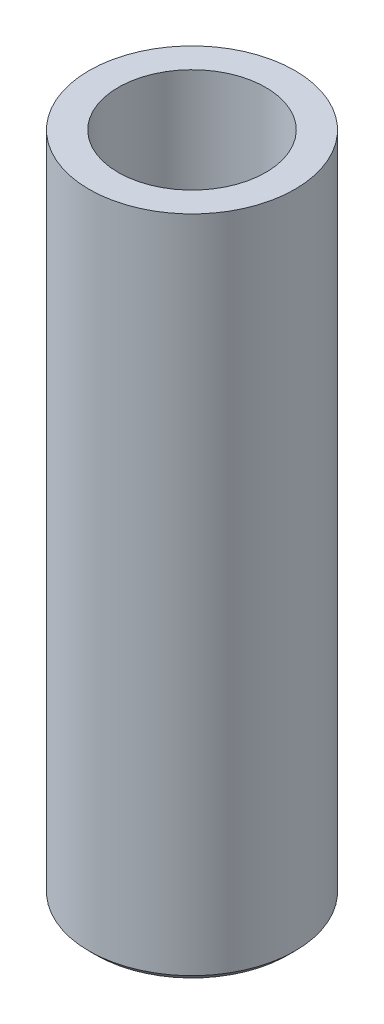
ISO-10303-21;
HEADER;
FILE_DESCRIPTION(('STEP AP214'),'2;1');
FILE_NAME('part.step','',(''),(''),'','','');
FILE_SCHEMA(('AUTOMOTIVE_DESIGN { 1 0 10303 214 1 1 1 1 }'));
ENDSEC;
DATA;
#1=APPLICATION_CONTEXT('core data for automotive mechanical design processes');
#2=APPLICATION_PROTOCOL_DEFINITION('international standard','automotive_design',2000,#1);
#3=PRODUCT_CONTEXT('',#1,'mechanical');
#4=PRODUCT('Part','Part','',(#3));
#5=PRODUCT_RELATED_PRODUCT_CATEGORY('part','',(#4));
#6=PRODUCT_DEFINITION_FORMATION('','',#4);
#7=PRODUCT_DEFINITION_CONTEXT('part definition',#1,'design');
#8=PRODUCT_DEFINITION('design','',#6,#7);
#9=PRODUCT_DEFINITION_SHAPE('','',#8);
#10=(LENGTH_UNIT() NAMED_UNIT(*) SI_UNIT(.MILLI.,.METRE.));
#11=(NAMED_UNIT(*) PLANE_ANGLE_UNIT() SI_UNIT($,.RADIAN.));
#12=(NAMED_UNIT(*) SI_UNIT($,.STERADIAN.) SOLID_ANGLE_UNIT());
#13=UNCERTAINTY_MEASURE_WITH_UNIT(LENGTH_MEASURE(1.E-05),#10,'distance_accuracy_value','');
#14=(GEOMETRIC_REPRESENTATION_CONTEXT(3) GLOBAL_UNCERTAINTY_ASSIGNED_CONTEXT((#13)) GLOBAL_UNIT_ASSIGNED_CONTEXT((#10,
#11,#12)) REPRESENTATION_CONTEXT('',''));
#15=CARTESIAN_POINT('',(0.,0.,0.));
#16=DIRECTION('',(0.,0.,1.));
#17=DIRECTION('',(1.,0.,0.));
#18=AXIS2_PLACEMENT_3D('',#15,#16,#17);
#19=CARTESIAN_POINT('',(0.,1.,0.));
#20=DIRECTION('',(0.,-1.,0.));
#21=DIRECTION('',(0.,0.,-1.));
#22=AXIS2_PLACEMENT_3D('',#19,#20,#21);
#23=CYLINDRICAL_SURFACE('',#22,6.);
#24=CARTESIAN_POINT('',(0.,0.399999999999996,0.));
#25=DIRECTION('',(0.,1.,0.));
#26=DIRECTION('',(0.,0.,1.));
#27=AXIS2_PLACEMENT_3D('',#24,#25,#26);
#28=CIRCLE('',#27,6.);
#29=CARTESIAN_POINT('',(0.,0.399999999999996,6.));
#30=VERTEX_POINT('',#29);
#31=EDGE_CURVE('E49',#30,#30,#28,.T.);
#32=ORIENTED_EDGE('',*,*,#31,.T.);
#33=EDGE_LOOP('',(#32));
#34=FACE_BOUND('',#33,.T.);
#35=CARTESIAN_POINT('',(0.,38.86,0.));
#36=DIRECTION('',(0.,1.,0.));
#37=DIRECTION('',(0.,0.,1.));
#38=AXIS2_PLACEMENT_3D('',#35,#36,#37);
#39=CIRCLE('',#38,6.);
#40=CARTESIAN_POINT('',(0.,38.86,6.));
#41=VERTEX_POINT('',#40);
#42=EDGE_CURVE('E57',#41,#41,#39,.T.);
#43=ORIENTED_EDGE('',*,*,#42,.F.);
#44=EDGE_LOOP('',(#43));
#45=FACE_BOUND('',#44,.T.);
#46=ADVANCED_FACE('F42',(#34,#45),#23,.T.);
#47=CARTESIAN_POINT('',(0.,0.,0.));
#48=DIRECTION('',(0.,1.,0.));
#49=DIRECTION('',(0.,0.,1.));
#50=AXIS2_PLACEMENT_3D('',#47,#48,#49);
#51=PLANE('',#50);
#52=CARTESIAN_POINT('',(0.,0.,0.));
#53=DIRECTION('',(0.,1.,0.));
#54=DIRECTION('',(0.,0.,1.));
#55=AXIS2_PLACEMENT_3D('',#52,#53,#54);
#56=CIRCLE('',#55,5.6);
#57=CARTESIAN_POINT('',(0.,0.,5.6));
#58=VERTEX_POINT('',#57);
#59=EDGE_CURVE('E12',#58,#58,#56,.F.);
#60=ORIENTED_EDGE('',*,*,#59,.T.);
#61=EDGE_LOOP('',(#60));
#62=FACE_BOUND('',#61,.T.);
#63=ADVANCED_FACE('F71',(#62),#51,.F.);
#64=CARTESIAN_POINT('',(0.,38.86,0.));
#65=DIRECTION('',(0.,1.,0.));
#66=DIRECTION('',(0.,0.,1.));
#67=AXIS2_PLACEMENT_3D('',#64,#65,#66);
#68=PLANE('',#67);
#69=ORIENTED_EDGE('',*,*,#42,.T.);
#70=EDGE_LOOP('',(#69));
#71=FACE_BOUND('',#70,.T.);
#72=CARTESIAN_POINT('',(0.,38.86,0.));
#73=DIRECTION('',(0.,1.,0.));
#74=DIRECTION('',(0.,0.,1.));
#75=AXIS2_PLACEMENT_3D('',#72,#73,#74);
#76=CIRCLE('',#75,4.3);
#77=CARTESIAN_POINT('',(0.,38.86,4.3));
#78=VERTEX_POINT('',#77);
#79=EDGE_CURVE('E62',#78,#78,#76,.T.);
#80=ORIENTED_EDGE('',*,*,#79,.F.);
#81=EDGE_LOOP('',(#80));
#82=FACE_BOUND('',#81,.T.);
#83=ADVANCED_FACE('F69',(#71,#82),#68,.T.);
#84=CARTESIAN_POINT('',(0.,38.86,0.));
#85=DIRECTION('',(0.,-1.,0.));
#86=DIRECTION('',(0.,0.,-1.));
#87=AXIS2_PLACEMENT_3D('',#84,#85,#86);
#88=CYLINDRICAL_SURFACE('',#87,4.3);
#89=ORIENTED_EDGE('',*,*,#79,.T.);
#90=EDGE_LOOP('',(#89));
#91=FACE_BOUND('',#90,.T.);
#92=CARTESIAN_POINT('',(0.,1.,0.));
#93=DIRECTION('',(0.,1.,0.));
#94=DIRECTION('',(0.,0.,1.));
#95=AXIS2_PLACEMENT_3D('',#92,#93,#94);
#96=CIRCLE('',#95,4.3);
#97=CARTESIAN_POINT('',(0.,1.,4.3));
#98=VERTEX_POINT('',#97);
#99=EDGE_CURVE('E53',#98,#98,#96,.F.);
#100=ORIENTED_EDGE('',*,*,#99,.T.);
#101=EDGE_LOOP('',(#100));
#102=FACE_BOUND('',#101,.T.);
#103=ADVANCED_FACE('F66',(#91,#102),#88,.F.);
#104=CARTESIAN_POINT('',(0.,1.,0.));
#105=DIRECTION('',(0.,1.,0.));
#106=DIRECTION('',(0.,0.,1.));
#107=AXIS2_PLACEMENT_3D('',#104,#105,#106);
#108=PLANE('',#107);
#109=ORIENTED_EDGE('',*,*,#99,.F.);
#110=EDGE_LOOP('',(#109));
#111=FACE_BOUND('',#110,.T.);
#112=ADVANCED_FACE('F78',(#111),#108,.T.);
#113=CARTESIAN_POINT('',(0.,0.399999999999996,0.));
#114=DIRECTION('',(0.,1.,0.));
#115=DIRECTION('',(0.,0.,1.));
#116=AXIS2_PLACEMENT_3D('',#113,#114,#115);
#117=CONICAL_SURFACE('',#116,6.,0.785398163397448);
#118=ORIENTED_EDGE('',*,*,#59,.F.);
#119=EDGE_LOOP('',(#118));
#120=FACE_BOUND('',#119,.T.);
#121=ORIENTED_EDGE('',*,*,#31,.F.);
#122=EDGE_LOOP('',(#121));
#123=FACE_BOUND('',#122,.T.);
#124=ADVANCED_FACE('F44',(#120,#123),#117,.T.);
#125=CLOSED_SHELL('',(#46,#63,#83,#103,#112,#124));
#126=MANIFOLD_SOLID_BREP('B2',#125);
#127=ADVANCED_BREP_SHAPE_REPRESENTATION('',(#18,#126),#14);
#128=SHAPE_DEFINITION_REPRESENTATION(#9,#127);
ENDSEC;
END-ISO-10303-21;
